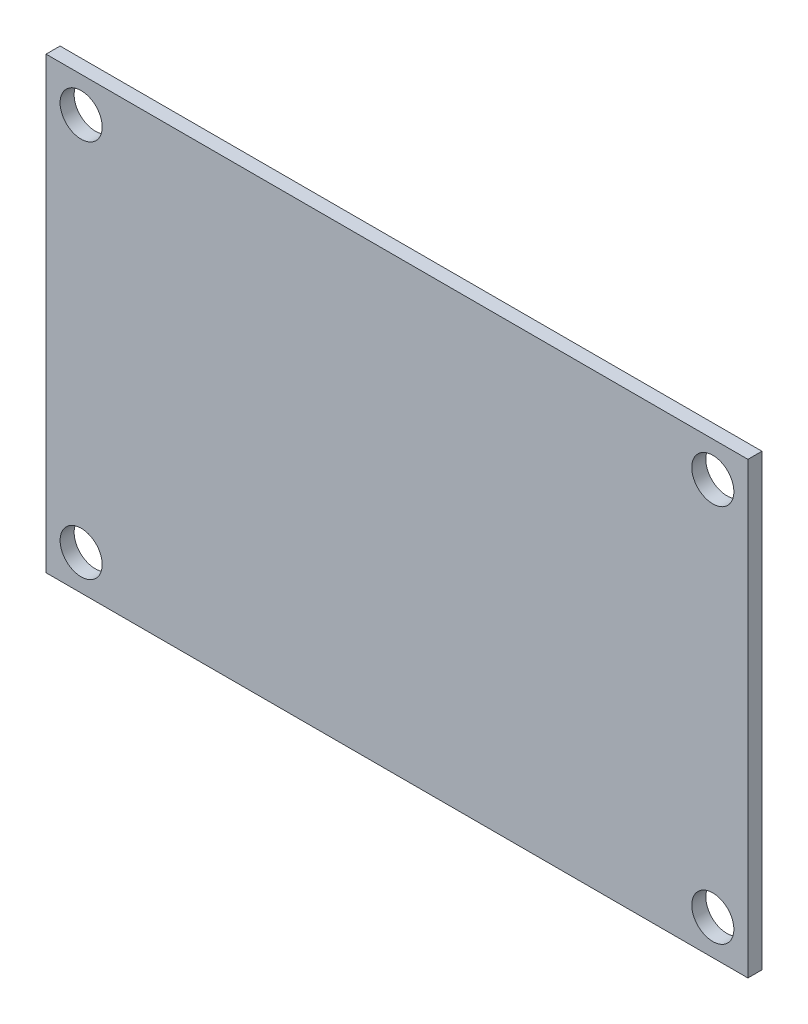
ISO-10303-21;
HEADER;
FILE_DESCRIPTION(('STEP AP214'),'2;1');
FILE_NAME('part.step','',(''),(''),'','','');
FILE_SCHEMA(('AUTOMOTIVE_DESIGN { 1 0 10303 214 1 1 1 1 }'));
ENDSEC;
DATA;
#1=APPLICATION_CONTEXT('core data for automotive mechanical design processes');
#2=APPLICATION_PROTOCOL_DEFINITION('international standard','automotive_design',2000,#1);
#3=PRODUCT_CONTEXT('',#1,'mechanical');
#4=PRODUCT('Part','Part','',(#3));
#5=PRODUCT_RELATED_PRODUCT_CATEGORY('part','',(#4));
#6=PRODUCT_DEFINITION_FORMATION('','',#4);
#7=PRODUCT_DEFINITION_CONTEXT('part definition',#1,'design');
#8=PRODUCT_DEFINITION('design','',#6,#7);
#9=PRODUCT_DEFINITION_SHAPE('','',#8);
#10=(LENGTH_UNIT() NAMED_UNIT(*) SI_UNIT(.MILLI.,.METRE.));
#11=(NAMED_UNIT(*) PLANE_ANGLE_UNIT() SI_UNIT($,.RADIAN.));
#12=(NAMED_UNIT(*) SI_UNIT($,.STERADIAN.) SOLID_ANGLE_UNIT());
#13=UNCERTAINTY_MEASURE_WITH_UNIT(LENGTH_MEASURE(1.E-05),#10,'distance_accuracy_value','');
#14=(GEOMETRIC_REPRESENTATION_CONTEXT(3) GLOBAL_UNCERTAINTY_ASSIGNED_CONTEXT((#13)) GLOBAL_UNIT_ASSIGNED_CONTEXT((#10,
#11,#12)) REPRESENTATION_CONTEXT('',''));
#15=CARTESIAN_POINT('',(0.,0.,0.));
#16=DIRECTION('',(0.,0.,1.));
#17=DIRECTION('',(1.,0.,0.));
#18=AXIS2_PLACEMENT_3D('',#15,#16,#17);
#19=CARTESIAN_POINT('',(0.,0.,1.));
#20=DIRECTION('',(1.,0.,0.));
#21=DIRECTION('',(0.,0.,-1.));
#22=AXIS2_PLACEMENT_3D('',#19,#20,#21);
#23=PLANE('',#22);
#24=DIRECTION('',(0.,-1.,0.));
#25=VECTOR('',#24,1.);
#26=CARTESIAN_POINT('',(0.,0.,0.));
#27=LINE('',#26,#25);
#28=CARTESIAN_POINT('',(0.,32.,0.));
#29=VERTEX_POINT('',#28);
#30=CARTESIAN_POINT('',(0.,0.,0.));
#31=VERTEX_POINT('',#30);
#32=EDGE_CURVE('E96',#29,#31,#27,.T.);
#33=ORIENTED_EDGE('',*,*,#32,.T.);
#34=DIRECTION('',(0.,0.,-1.));
#35=VECTOR('',#34,1.);
#36=CARTESIAN_POINT('',(0.,0.,1.));
#37=LINE('',#36,#35);
#38=CARTESIAN_POINT('',(0.,0.,1.));
#39=VERTEX_POINT('',#38);
#40=EDGE_CURVE('E11',#39,#31,#37,.T.);
#41=ORIENTED_EDGE('',*,*,#40,.F.);
#42=DIRECTION('',(0.,-1.,0.));
#43=VECTOR('',#42,1.);
#44=CARTESIAN_POINT('',(0.,0.,1.));
#45=LINE('',#44,#43);
#46=CARTESIAN_POINT('',(0.,32.,1.));
#47=VERTEX_POINT('',#46);
#48=EDGE_CURVE('E84',#47,#39,#45,.T.);
#49=ORIENTED_EDGE('',*,*,#48,.F.);
#50=DIRECTION('',(0.,0.,-1.));
#51=VECTOR('',#50,1.);
#52=CARTESIAN_POINT('',(0.,32.,1.));
#53=LINE('',#52,#51);
#54=EDGE_CURVE('E92',#47,#29,#53,.T.);
#55=ORIENTED_EDGE('',*,*,#54,.T.);
#56=EDGE_LOOP('',(#33,#41,#49,#55));
#57=FACE_BOUND('',#56,.T.);
#58=ADVANCED_FACE('F33',(#57),#23,.F.);
#59=CARTESIAN_POINT('',(0.,0.,1.));
#60=DIRECTION('',(0.,1.,0.));
#61=DIRECTION('',(0.,0.,1.));
#62=AXIS2_PLACEMENT_3D('',#59,#60,#61);
#63=PLANE('',#62);
#64=DIRECTION('',(1.,0.,0.));
#65=VECTOR('',#64,1.);
#66=CARTESIAN_POINT('',(0.,0.,0.));
#67=LINE('',#66,#65);
#68=CARTESIAN_POINT('',(50.,0.,0.));
#69=VERTEX_POINT('',#68);
#70=EDGE_CURVE('E88',#31,#69,#67,.T.);
#71=ORIENTED_EDGE('',*,*,#70,.T.);
#72=DIRECTION('',(0.,0.,-1.));
#73=VECTOR('',#72,1.);
#74=CARTESIAN_POINT('',(50.,0.,1.));
#75=LINE('',#74,#73);
#76=CARTESIAN_POINT('',(50.,0.,1.));
#77=VERTEX_POINT('',#76);
#78=EDGE_CURVE('E41',#77,#69,#75,.T.);
#79=ORIENTED_EDGE('',*,*,#78,.F.);
#80=DIRECTION('',(1.,0.,0.));
#81=VECTOR('',#80,1.);
#82=CARTESIAN_POINT('',(0.,0.,1.));
#83=LINE('',#82,#81);
#84=EDGE_CURVE('E79',#39,#77,#83,.T.);
#85=ORIENTED_EDGE('',*,*,#84,.F.);
#86=ORIENTED_EDGE('',*,*,#40,.T.);
#87=EDGE_LOOP('',(#71,#79,#85,#86));
#88=FACE_BOUND('',#87,.T.);
#89=ADVANCED_FACE('F87',(#88),#63,.F.);
#90=CARTESIAN_POINT('',(50.,0.,1.));
#91=DIRECTION('',(-1.,0.,0.));
#92=DIRECTION('',(0.,0.,1.));
#93=AXIS2_PLACEMENT_3D('',#90,#91,#92);
#94=PLANE('',#93);
#95=DIRECTION('',(0.,1.,0.));
#96=VECTOR('',#95,1.);
#97=CARTESIAN_POINT('',(50.,0.,0.));
#98=LINE('',#97,#96);
#99=CARTESIAN_POINT('',(50.,32.,0.));
#100=VERTEX_POINT('',#99);
#101=EDGE_CURVE('E66',#69,#100,#98,.T.);
#102=ORIENTED_EDGE('',*,*,#101,.T.);
#103=DIRECTION('',(0.,0.,-1.));
#104=VECTOR('',#103,1.);
#105=CARTESIAN_POINT('',(50.,32.,1.));
#106=LINE('',#105,#104);
#107=CARTESIAN_POINT('',(50.,32.,1.));
#108=VERTEX_POINT('',#107);
#109=EDGE_CURVE('E89',#108,#100,#106,.T.);
#110=ORIENTED_EDGE('',*,*,#109,.F.);
#111=DIRECTION('',(0.,1.,0.));
#112=VECTOR('',#111,1.);
#113=CARTESIAN_POINT('',(50.,0.,1.));
#114=LINE('',#113,#112);
#115=EDGE_CURVE('E82',#77,#108,#114,.T.);
#116=ORIENTED_EDGE('',*,*,#115,.F.);
#117=ORIENTED_EDGE('',*,*,#78,.T.);
#118=EDGE_LOOP('',(#102,#110,#116,#117));
#119=FACE_BOUND('',#118,.T.);
#120=ADVANCED_FACE('F90',(#119),#94,.F.);
#121=CARTESIAN_POINT('',(0.,32.,1.));
#122=DIRECTION('',(0.,-1.,0.));
#123=DIRECTION('',(0.,0.,-1.));
#124=AXIS2_PLACEMENT_3D('',#121,#122,#123);
#125=PLANE('',#124);
#126=DIRECTION('',(-1.,0.,0.));
#127=VECTOR('',#126,1.);
#128=CARTESIAN_POINT('',(0.,32.,0.));
#129=LINE('',#128,#127);
#130=EDGE_CURVE('E72',#100,#29,#129,.T.);
#131=ORIENTED_EDGE('',*,*,#130,.T.);
#132=ORIENTED_EDGE('',*,*,#54,.F.);
#133=DIRECTION('',(-1.,0.,0.));
#134=VECTOR('',#133,1.);
#135=CARTESIAN_POINT('',(0.,32.,1.));
#136=LINE('',#135,#134);
#137=EDGE_CURVE('E49',#108,#47,#136,.T.);
#138=ORIENTED_EDGE('',*,*,#137,.F.);
#139=ORIENTED_EDGE('',*,*,#109,.T.);
#140=EDGE_LOOP('',(#131,#132,#138,#139));
#141=FACE_BOUND('',#140,.T.);
#142=ADVANCED_FACE('F104',(#141),#125,.F.);
#143=CARTESIAN_POINT('',(0.,0.,1.));
#144=DIRECTION('',(0.,0.,-1.));
#145=DIRECTION('',(-1.,0.,0.));
#146=AXIS2_PLACEMENT_3D('',#143,#144,#145);
#147=PLANE('',#146);
#148=CARTESIAN_POINT('',(47.5,29.5,1.));
#149=DIRECTION('',(0.,0.,-1.));
#150=DIRECTION('',(1.,0.,0.));
#151=AXIS2_PLACEMENT_3D('',#148,#149,#150);
#152=CIRCLE('',#151,1.5);
#153=CARTESIAN_POINT('',(49.,29.5,1.));
#154=VERTEX_POINT('',#153);
#155=EDGE_CURVE('E119',#154,#154,#152,.T.);
#156=ORIENTED_EDGE('',*,*,#155,.T.);
#157=EDGE_LOOP('',(#156));
#158=FACE_BOUND('',#157,.T.);
#159=CARTESIAN_POINT('',(47.5,2.5,1.));
#160=DIRECTION('',(0.,0.,-1.));
#161=DIRECTION('',(-1.,0.,0.));
#162=AXIS2_PLACEMENT_3D('',#159,#160,#161);
#163=CIRCLE('',#162,1.5);
#164=CARTESIAN_POINT('',(46.,2.5,1.));
#165=VERTEX_POINT('',#164);
#166=EDGE_CURVE('E125',#165,#165,#163,.T.);
#167=ORIENTED_EDGE('',*,*,#166,.T.);
#168=EDGE_LOOP('',(#167));
#169=FACE_BOUND('',#168,.T.);
#170=CARTESIAN_POINT('',(2.5,2.5,1.));
#171=DIRECTION('',(0.,0.,-1.));
#172=DIRECTION('',(1.,0.,0.));
#173=AXIS2_PLACEMENT_3D('',#170,#171,#172);
#174=CIRCLE('',#173,1.5);
#175=CARTESIAN_POINT('',(4.,2.5,1.));
#176=VERTEX_POINT('',#175);
#177=EDGE_CURVE('E113',#176,#176,#174,.T.);
#178=ORIENTED_EDGE('',*,*,#177,.T.);
#179=EDGE_LOOP('',(#178));
#180=FACE_BOUND('',#179,.T.);
#181=CARTESIAN_POINT('',(2.5,29.5,1.));
#182=DIRECTION('',(0.,0.,-1.));
#183=DIRECTION('',(-1.,0.,0.));
#184=AXIS2_PLACEMENT_3D('',#181,#182,#183);
#185=CIRCLE('',#184,1.5);
#186=CARTESIAN_POINT('',(0.999999999999999,29.5,1.));
#187=VERTEX_POINT('',#186);
#188=EDGE_CURVE('E99',#187,#187,#185,.T.);
#189=ORIENTED_EDGE('',*,*,#188,.T.);
#190=EDGE_LOOP('',(#189));
#191=FACE_BOUND('',#190,.T.);
#192=ORIENTED_EDGE('',*,*,#48,.T.);
#193=ORIENTED_EDGE('',*,*,#84,.T.);
#194=ORIENTED_EDGE('',*,*,#115,.T.);
#195=ORIENTED_EDGE('',*,*,#137,.T.);
#196=EDGE_LOOP('',(#192,#193,#194,#195));
#197=FACE_BOUND('',#196,.T.);
#198=ADVANCED_FACE('F80',(#158,#169,#180,#191,#197),#147,.F.);
#199=CARTESIAN_POINT('',(0.,0.,0.));
#200=DIRECTION('',(0.,0.,-1.));
#201=DIRECTION('',(-1.,0.,0.));
#202=AXIS2_PLACEMENT_3D('',#199,#200,#201);
#203=PLANE('',#202);
#204=CARTESIAN_POINT('',(47.5,29.5,0.));
#205=DIRECTION('',(0.,0.,-1.));
#206=DIRECTION('',(1.,0.,0.));
#207=AXIS2_PLACEMENT_3D('',#204,#205,#206);
#208=CIRCLE('',#207,1.5);
#209=CARTESIAN_POINT('',(49.,29.5,0.));
#210=VERTEX_POINT('',#209);
#211=EDGE_CURVE('E116',#210,#210,#208,.T.);
#212=ORIENTED_EDGE('',*,*,#211,.F.);
#213=EDGE_LOOP('',(#212));
#214=FACE_BOUND('',#213,.T.);
#215=CARTESIAN_POINT('',(47.5,2.5,0.));
#216=DIRECTION('',(0.,0.,-1.));
#217=DIRECTION('',(-1.,0.,0.));
#218=AXIS2_PLACEMENT_3D('',#215,#216,#217);
#219=CIRCLE('',#218,1.5);
#220=CARTESIAN_POINT('',(46.,2.5,0.));
#221=VERTEX_POINT('',#220);
#222=EDGE_CURVE('E122',#221,#221,#219,.T.);
#223=ORIENTED_EDGE('',*,*,#222,.F.);
#224=EDGE_LOOP('',(#223));
#225=FACE_BOUND('',#224,.T.);
#226=CARTESIAN_POINT('',(2.5,2.5,0.));
#227=DIRECTION('',(0.,0.,-1.));
#228=DIRECTION('',(1.,0.,0.));
#229=AXIS2_PLACEMENT_3D('',#226,#227,#228);
#230=CIRCLE('',#229,1.5);
#231=CARTESIAN_POINT('',(4.,2.5,0.));
#232=VERTEX_POINT('',#231);
#233=EDGE_CURVE('E128',#232,#232,#230,.T.);
#234=ORIENTED_EDGE('',*,*,#233,.F.);
#235=EDGE_LOOP('',(#234));
#236=FACE_BOUND('',#235,.T.);
#237=CARTESIAN_POINT('',(2.5,29.5,0.));
#238=DIRECTION('',(0.,0.,-1.));
#239=DIRECTION('',(-1.,0.,0.));
#240=AXIS2_PLACEMENT_3D('',#237,#238,#239);
#241=CIRCLE('',#240,1.5);
#242=CARTESIAN_POINT('',(0.999999999999999,29.5,0.));
#243=VERTEX_POINT('',#242);
#244=EDGE_CURVE('E110',#243,#243,#241,.T.);
#245=ORIENTED_EDGE('',*,*,#244,.F.);
#246=EDGE_LOOP('',(#245));
#247=FACE_BOUND('',#246,.T.);
#248=ORIENTED_EDGE('',*,*,#32,.F.);
#249=ORIENTED_EDGE('',*,*,#130,.F.);
#250=ORIENTED_EDGE('',*,*,#101,.F.);
#251=ORIENTED_EDGE('',*,*,#70,.F.);
#252=EDGE_LOOP('',(#248,#249,#250,#251));
#253=FACE_BOUND('',#252,.T.);
#254=ADVANCED_FACE('F107',(#214,#225,#236,#247,#253),#203,.T.);
#255=CARTESIAN_POINT('',(2.5,29.5,1.));
#256=DIRECTION('',(0.,0.,-1.));
#257=DIRECTION('',(-1.,0.,0.));
#258=AXIS2_PLACEMENT_3D('',#255,#256,#257);
#259=CYLINDRICAL_SURFACE('',#258,1.5);
#260=ORIENTED_EDGE('',*,*,#188,.F.);
#261=EDGE_LOOP('',(#260));
#262=FACE_BOUND('',#261,.T.);
#263=ORIENTED_EDGE('',*,*,#244,.T.);
#264=EDGE_LOOP('',(#263));
#265=FACE_BOUND('',#264,.T.);
#266=ADVANCED_FACE('F140',(#262,#265),#259,.F.);
#267=CARTESIAN_POINT('',(2.5,2.5,1.));
#268=DIRECTION('',(0.,0.,-1.));
#269=DIRECTION('',(-1.,0.,0.));
#270=AXIS2_PLACEMENT_3D('',#267,#268,#269);
#271=CYLINDRICAL_SURFACE('',#270,1.5);
#272=ORIENTED_EDGE('',*,*,#177,.F.);
#273=EDGE_LOOP('',(#272));
#274=FACE_BOUND('',#273,.T.);
#275=ORIENTED_EDGE('',*,*,#233,.T.);
#276=EDGE_LOOP('',(#275));
#277=FACE_BOUND('',#276,.T.);
#278=ADVANCED_FACE('F136',(#274,#277),#271,.F.);
#279=CARTESIAN_POINT('',(47.5,2.5,1.));
#280=DIRECTION('',(0.,0.,-1.));
#281=DIRECTION('',(-1.,0.,0.));
#282=AXIS2_PLACEMENT_3D('',#279,#280,#281);
#283=CYLINDRICAL_SURFACE('',#282,1.5);
#284=ORIENTED_EDGE('',*,*,#166,.F.);
#285=EDGE_LOOP('',(#284));
#286=FACE_BOUND('',#285,.T.);
#287=ORIENTED_EDGE('',*,*,#222,.T.);
#288=EDGE_LOOP('',(#287));
#289=FACE_BOUND('',#288,.T.);
#290=ADVANCED_FACE('F139',(#286,#289),#283,.F.);
#291=CARTESIAN_POINT('',(47.5,29.5,1.));
#292=DIRECTION('',(0.,0.,-1.));
#293=DIRECTION('',(-1.,0.,0.));
#294=AXIS2_PLACEMENT_3D('',#291,#292,#293);
#295=CYLINDRICAL_SURFACE('',#294,1.5);
#296=ORIENTED_EDGE('',*,*,#155,.F.);
#297=EDGE_LOOP('',(#296));
#298=FACE_BOUND('',#297,.T.);
#299=ORIENTED_EDGE('',*,*,#211,.T.);
#300=EDGE_LOOP('',(#299));
#301=FACE_BOUND('',#300,.T.);
#302=ADVANCED_FACE('F180',(#298,#301),#295,.F.);
#303=CLOSED_SHELL('',(#58,#89,#120,#142,#198,#254,#266,#278,#290,#302));
#304=MANIFOLD_SOLID_BREP('B2',#303);
#305=ADVANCED_BREP_SHAPE_REPRESENTATION('',(#18,#304),#14);
#306=SHAPE_DEFINITION_REPRESENTATION(#9,#305);
ENDSEC;
END-ISO-10303-21;
